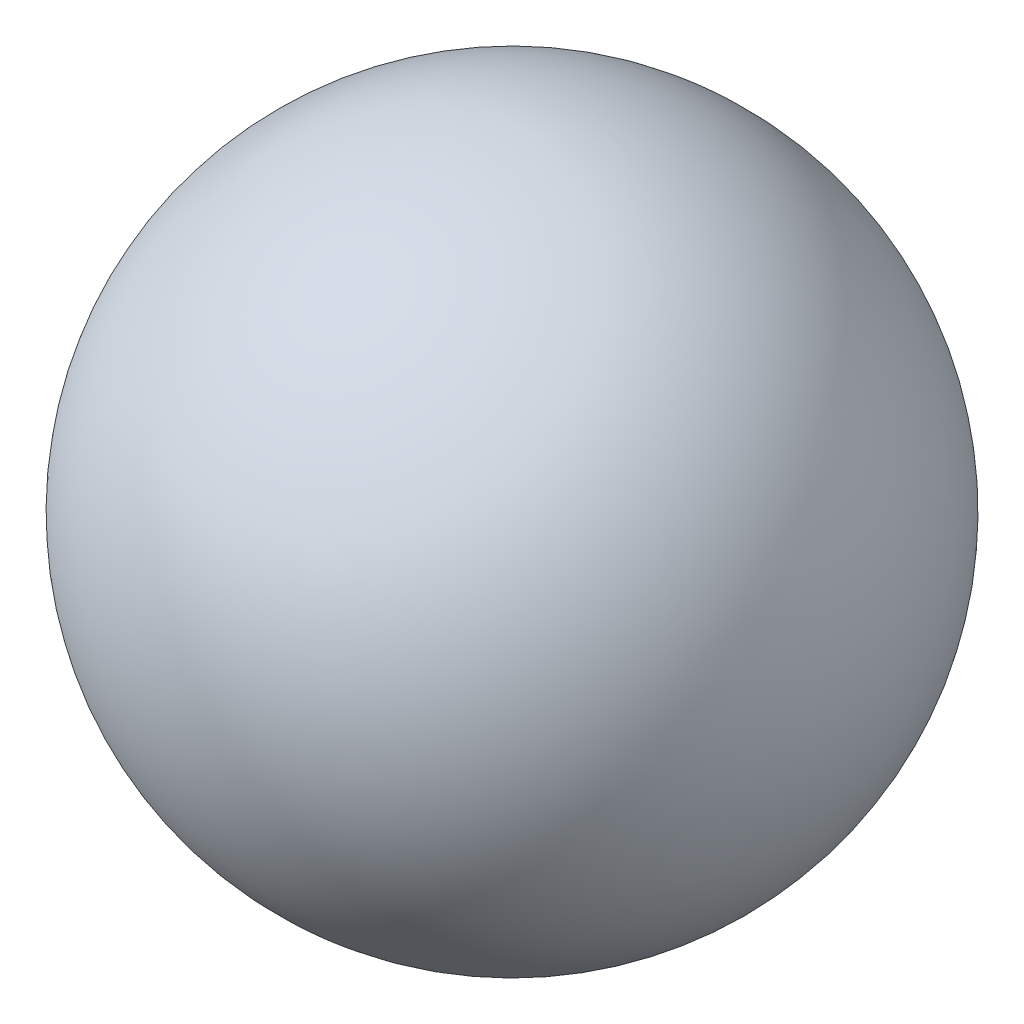
ISO-10303-21;
HEADER;
FILE_DESCRIPTION(('STEP AP214'),'2;1');
FILE_NAME('part.step','',(''),(''),'','','');
FILE_SCHEMA(('AUTOMOTIVE_DESIGN { 1 0 10303 214 1 1 1 1 }'));
ENDSEC;
DATA;
#1=APPLICATION_CONTEXT('core data for automotive mechanical design processes');
#2=APPLICATION_PROTOCOL_DEFINITION('international standard','automotive_design',2000,#1);
#3=PRODUCT_CONTEXT('',#1,'mechanical');
#4=PRODUCT('Part','Part','',(#3));
#5=PRODUCT_RELATED_PRODUCT_CATEGORY('part','',(#4));
#6=PRODUCT_DEFINITION_FORMATION('','',#4);
#7=PRODUCT_DEFINITION_CONTEXT('part definition',#1,'design');
#8=PRODUCT_DEFINITION('design','',#6,#7);
#9=PRODUCT_DEFINITION_SHAPE('','',#8);
#10=(LENGTH_UNIT() NAMED_UNIT(*) SI_UNIT(.MILLI.,.METRE.));
#11=(NAMED_UNIT(*) PLANE_ANGLE_UNIT() SI_UNIT($,.RADIAN.));
#12=(NAMED_UNIT(*) SI_UNIT($,.STERADIAN.) SOLID_ANGLE_UNIT());
#13=UNCERTAINTY_MEASURE_WITH_UNIT(LENGTH_MEASURE(1.E-05),#10,'distance_accuracy_value','');
#14=(GEOMETRIC_REPRESENTATION_CONTEXT(3) GLOBAL_UNCERTAINTY_ASSIGNED_CONTEXT((#13)) GLOBAL_UNIT_ASSIGNED_CONTEXT((#10,
#11,#12)) REPRESENTATION_CONTEXT('',''));
#15=CARTESIAN_POINT('',(0.,0.,0.));
#16=DIRECTION('',(0.,0.,1.));
#17=DIRECTION('',(1.,0.,0.));
#18=AXIS2_PLACEMENT_3D('',#15,#16,#17);
#19=CARTESIAN_POINT('',(64.16,-57.0308282276943,39.5156338765206));
#20=DIRECTION('',(0.,-0.821971206602399,0.569529047122792));
#21=DIRECTION('',(0.173648177666934,-0.560876621172181,-0.809483617014842));
#22=AXIS2_PLACEMENT_3D('',#19,#20,#21);
#23=SPHERICAL_SURFACE('',#22,7.15);
#24=CARTESIAN_POINT('',(64.16,-51.1537341004871,35.4435011895926));
#25=VERTEX_POINT('',#24);
#26=VERTEX_LOOP('',#25);
#27=FACE_BOUND('',#26,.T.);
#28=CARTESIAN_POINT('',(64.16,-62.9079223549014,43.5877665634486));
#29=VERTEX_POINT('',#28);
#30=VERTEX_LOOP('',#29);
#31=FACE_BOUND('',#30,.T.);
#32=ADVANCED_FACE('F16',(#27,#31),#23,.T.);
#33=CLOSED_SHELL('',(#32));
#34=MANIFOLD_SOLID_BREP('B1',#33);
#35=ADVANCED_BREP_SHAPE_REPRESENTATION('',(#18,#34),#14);
#36=SHAPE_DEFINITION_REPRESENTATION(#9,#35);
ENDSEC;
END-ISO-10303-21;
